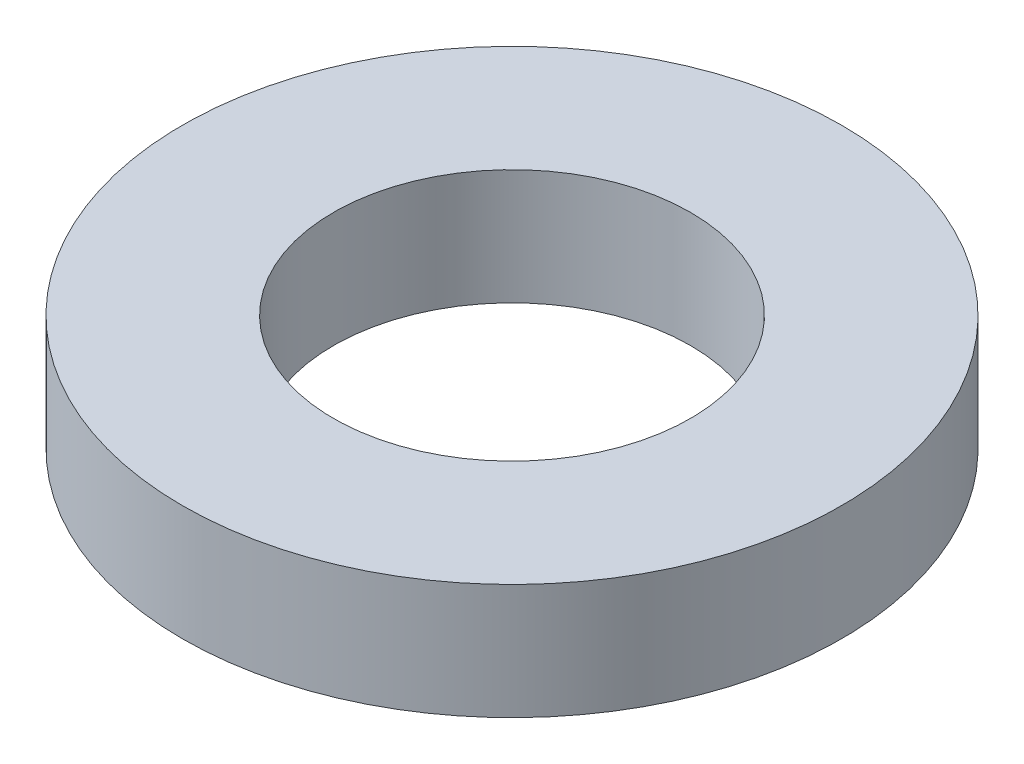
ISO-10303-21;
HEADER;
FILE_DESCRIPTION(('STEP AP214'),'2;1');
FILE_NAME('part.step','',(''),(''),'','','');
FILE_SCHEMA(('AUTOMOTIVE_DESIGN { 1 0 10303 214 1 1 1 1 }'));
ENDSEC;
DATA;
#1=APPLICATION_CONTEXT('core data for automotive mechanical design processes');
#2=APPLICATION_PROTOCOL_DEFINITION('international standard','automotive_design',2000,#1);
#3=PRODUCT_CONTEXT('',#1,'mechanical');
#4=PRODUCT('Part','Part','',(#3));
#5=PRODUCT_RELATED_PRODUCT_CATEGORY('part','',(#4));
#6=PRODUCT_DEFINITION_FORMATION('','',#4);
#7=PRODUCT_DEFINITION_CONTEXT('part definition',#1,'design');
#8=PRODUCT_DEFINITION('design','',#6,#7);
#9=PRODUCT_DEFINITION_SHAPE('','',#8);
#10=(LENGTH_UNIT() NAMED_UNIT(*) SI_UNIT(.MILLI.,.METRE.));
#11=(NAMED_UNIT(*) PLANE_ANGLE_UNIT() SI_UNIT($,.RADIAN.));
#12=(NAMED_UNIT(*) SI_UNIT($,.STERADIAN.) SOLID_ANGLE_UNIT());
#13=UNCERTAINTY_MEASURE_WITH_UNIT(LENGTH_MEASURE(1.E-05),#10,'distance_accuracy_value','');
#14=(GEOMETRIC_REPRESENTATION_CONTEXT(3) GLOBAL_UNCERTAINTY_ASSIGNED_CONTEXT((#13)) GLOBAL_UNIT_ASSIGNED_CONTEXT((#10,
#11,#12)) REPRESENTATION_CONTEXT('',''));
#15=CARTESIAN_POINT('',(0.,0.,0.));
#16=DIRECTION('',(0.,0.,1.));
#17=DIRECTION('',(1.,0.,0.));
#18=AXIS2_PLACEMENT_3D('',#15,#16,#17);
#19=CARTESIAN_POINT('',(0.,21.,0.));
#20=DIRECTION('',(0.,-1.,0.));
#21=DIRECTION('',(0.,0.,-1.));
#22=AXIS2_PLACEMENT_3D('',#19,#20,#21);
#23=CYLINDRICAL_SURFACE('',#22,60.);
#24=CARTESIAN_POINT('',(0.,21.,0.));
#25=DIRECTION('',(0.,1.,0.));
#26=DIRECTION('',(0.,0.,1.));
#27=AXIS2_PLACEMENT_3D('',#24,#25,#26);
#28=CIRCLE('',#27,60.);
#29=CARTESIAN_POINT('',(0.,21.,-60.));
#30=VERTEX_POINT('',#29);
#31=EDGE_CURVE('E10',#30,#30,#28,.T.);
#32=CARTESIAN_POINT('',(0.,0.,0.));
#33=DIRECTION('',(0.,1.,0.));
#34=DIRECTION('',(0.,0.,1.));
#35=AXIS2_PLACEMENT_3D('',#32,#33,#34);
#36=CIRCLE('',#35,60.);
#37=CARTESIAN_POINT('',(0.,0.,-60.));
#38=VERTEX_POINT('',#37);
#39=EDGE_CURVE('E37',#38,#38,#36,.T.);
#40=CARTESIAN_POINT('',(0.,21.,-60.));
#41=CARTESIAN_POINT('',(0.,20.78125,-60.));
#42=CARTESIAN_POINT('',(0.,20.5625,-60.));
#43=CARTESIAN_POINT('',(0.,20.125,-60.));
#44=CARTESIAN_POINT('',(0.,19.90625,-60.));
#45=CARTESIAN_POINT('',(0.,19.46875,-60.));
#46=CARTESIAN_POINT('',(0.,19.25,-60.));
#47=CARTESIAN_POINT('',(0.,18.8125,-60.));
#48=CARTESIAN_POINT('',(0.,18.59375,-60.));
#49=CARTESIAN_POINT('',(0.,18.15625,-60.));
#50=CARTESIAN_POINT('',(0.,17.9375,-60.));
#51=CARTESIAN_POINT('',(0.,17.5,-60.));
#52=CARTESIAN_POINT('',(0.,17.28125,-60.));
#53=CARTESIAN_POINT('',(0.,16.84375,-60.));
#54=CARTESIAN_POINT('',(0.,16.625,-60.));
#55=CARTESIAN_POINT('',(0.,16.1875,-60.));
#56=CARTESIAN_POINT('',(0.,15.96875,-60.));
#57=CARTESIAN_POINT('',(0.,15.53125,-60.));
#58=CARTESIAN_POINT('',(0.,15.3125,-60.));
#59=CARTESIAN_POINT('',(0.,14.875,-60.));
#60=CARTESIAN_POINT('',(0.,14.65625,-60.));
#61=CARTESIAN_POINT('',(0.,14.21875,-60.));
#62=CARTESIAN_POINT('',(0.,14.,-60.));
#63=CARTESIAN_POINT('',(0.,13.5625,-60.));
#64=CARTESIAN_POINT('',(0.,13.34375,-60.));
#65=CARTESIAN_POINT('',(0.,12.90625,-60.));
#66=CARTESIAN_POINT('',(0.,12.6875,-60.));
#67=CARTESIAN_POINT('',(0.,12.25,-60.));
#68=CARTESIAN_POINT('',(0.,12.03125,-60.));
#69=CARTESIAN_POINT('',(0.,11.59375,-60.));
#70=CARTESIAN_POINT('',(0.,11.375,-60.));
#71=CARTESIAN_POINT('',(0.,10.9375,-60.));
#72=CARTESIAN_POINT('',(0.,10.71875,-60.));
#73=CARTESIAN_POINT('',(0.,10.28125,-60.));
#74=CARTESIAN_POINT('',(0.,10.0625,-60.));
#75=CARTESIAN_POINT('',(0.,9.625,-60.));
#76=CARTESIAN_POINT('',(0.,9.40625,-60.));
#77=CARTESIAN_POINT('',(0.,8.96875,-60.));
#78=CARTESIAN_POINT('',(0.,8.75,-60.));
#79=CARTESIAN_POINT('',(0.,8.3125,-60.));
#80=CARTESIAN_POINT('',(0.,8.09375,-60.));
#81=CARTESIAN_POINT('',(0.,7.65625,-60.));
#82=CARTESIAN_POINT('',(0.,7.4375,-60.));
#83=CARTESIAN_POINT('',(0.,7.,-60.));
#84=CARTESIAN_POINT('',(0.,6.78125,-60.));
#85=CARTESIAN_POINT('',(0.,6.34375,-60.));
#86=CARTESIAN_POINT('',(0.,6.125,-60.));
#87=CARTESIAN_POINT('',(0.,5.6875,-60.));
#88=CARTESIAN_POINT('',(0.,5.46875,-60.));
#89=CARTESIAN_POINT('',(0.,5.03125,-60.));
#90=CARTESIAN_POINT('',(0.,4.8125,-60.));
#91=CARTESIAN_POINT('',(0.,4.375,-60.));
#92=CARTESIAN_POINT('',(0.,4.15625,-60.));
#93=CARTESIAN_POINT('',(0.,3.71875,-60.));
#94=CARTESIAN_POINT('',(0.,3.5,-60.));
#95=CARTESIAN_POINT('',(0.,3.0625,-60.));
#96=CARTESIAN_POINT('',(0.,2.84375,-60.));
#97=CARTESIAN_POINT('',(0.,2.40625,-60.));
#98=CARTESIAN_POINT('',(0.,2.1875,-60.));
#99=CARTESIAN_POINT('',(0.,1.75,-60.));
#100=CARTESIAN_POINT('',(0.,1.53125,-60.));
#101=CARTESIAN_POINT('',(0.,1.09375,-60.));
#102=CARTESIAN_POINT('',(0.,0.875000000000001,-60.));
#103=CARTESIAN_POINT('',(0.,0.4375,-60.));
#104=CARTESIAN_POINT('',(0.,0.21875,-60.));
#105=CARTESIAN_POINT('',(0.,0.,-60.));
#106=B_SPLINE_CURVE_WITH_KNOTS('',3,(#40,#41,#42,#43,#44,#45,#46,#47,#48,#49,#50,#51,#52,#53,
#54,#55,#56,#57,#58,#59,#60,#61,#62,#63,#64,#65,#66,#67,#68,#69,#70,#71,#72,#73,#74,#75,#76,#77,
#78,#79,#80,#81,#82,#83,#84,#85,#86,#87,#88,#89,#90,#91,#92,#93,#94,#95,#96,#97,#98,#99,#100,
#101,#102,#103,#104,#105),.UNSPECIFIED.,.F.,.F.,(4,2,2,2,2,2,2,2,2,2,2,2,2,2,2,2,2,2,2,2,2,2,2,
2,2,2,2,2,2,2,2,2,4),(0.,0.656250000000001,1.3125,1.96875,2.625,3.28125,3.9375,4.59375,5.25,
5.90625,6.5625,7.21875,7.875,8.53125,9.1875,9.84375,10.5,11.15625,11.8125,12.46875,13.125,
13.78125,14.4375,15.09375,15.75,16.40625,17.0625,17.71875,18.375,19.03125,19.6875,20.34375,21.),.UNSPECIFIED.);
#107=EDGE_CURVE('BSEAM40',#30,#38,#106,.T.);
#108=ORIENTED_EDGE('',*,*,#31,.F.);
#109=ORIENTED_EDGE('',*,*,#39,.T.);
#110=ORIENTED_EDGE('',*,*,#107,.T.);
#111=ORIENTED_EDGE('',*,*,#107,.F.);
#112=EDGE_LOOP('',(#108,#110,#109,#111));
#113=FACE_BOUND('',#112,.T.);
#114=ADVANCED_FACE('F40',(#113),#23,.T.);
#115=CARTESIAN_POINT('',(0.,21.,0.));
#116=DIRECTION('',(0.,1.,0.));
#117=DIRECTION('',(0.,0.,1.));
#118=AXIS2_PLACEMENT_3D('',#115,#116,#117);
#119=PLANE('',#118);
#120=CARTESIAN_POINT('',(0.,21.,0.));
#121=DIRECTION('',(0.,1.,0.));
#122=DIRECTION('',(0.,0.,1.));
#123=AXIS2_PLACEMENT_3D('',#120,#121,#122);
#124=CIRCLE('',#123,32.5);
#125=CARTESIAN_POINT('',(0.,21.,-32.5));
#126=VERTEX_POINT('',#125);
#127=EDGE_CURVE('E50',#126,#126,#124,.T.);
#128=ORIENTED_EDGE('',*,*,#127,.F.);
#129=EDGE_LOOP('',(#128));
#130=FACE_BOUND('',#129,.T.);
#131=ORIENTED_EDGE('',*,*,#31,.T.);
#132=EDGE_LOOP('',(#131));
#133=FACE_BOUND('',#132,.T.);
#134=ADVANCED_FACE('F59',(#130,#133),#119,.T.);
#135=CARTESIAN_POINT('',(0.,0.,0.));
#136=DIRECTION('',(0.,1.,0.));
#137=DIRECTION('',(0.,0.,1.));
#138=AXIS2_PLACEMENT_3D('',#135,#136,#137);
#139=PLANE('',#138);
#140=CARTESIAN_POINT('',(0.,0.,0.));
#141=DIRECTION('',(0.,1.,0.));
#142=DIRECTION('',(0.,0.,1.));
#143=AXIS2_PLACEMENT_3D('',#140,#141,#142);
#144=CIRCLE('',#143,32.5);
#145=CARTESIAN_POINT('',(0.,0.,-32.5));
#146=VERTEX_POINT('',#145);
#147=EDGE_CURVE('E47',#146,#146,#144,.T.);
#148=ORIENTED_EDGE('',*,*,#147,.T.);
#149=EDGE_LOOP('',(#148));
#150=FACE_BOUND('',#149,.T.);
#151=ORIENTED_EDGE('',*,*,#39,.F.);
#152=EDGE_LOOP('',(#151));
#153=FACE_BOUND('',#152,.T.);
#154=ADVANCED_FACE('F58',(#150,#153),#139,.F.);
#155=CARTESIAN_POINT('',(0.,21.,0.));
#156=DIRECTION('',(0.,-1.,0.));
#157=DIRECTION('',(0.,0.,-1.));
#158=AXIS2_PLACEMENT_3D('',#155,#156,#157);
#159=CYLINDRICAL_SURFACE('',#158,32.5);
#160=CARTESIAN_POINT('',(0.,21.,-32.5));
#161=CARTESIAN_POINT('',(0.,20.78125,-32.5));
#162=CARTESIAN_POINT('',(0.,20.5625,-32.5));
#163=CARTESIAN_POINT('',(0.,20.125,-32.5));
#164=CARTESIAN_POINT('',(0.,19.90625,-32.5));
#165=CARTESIAN_POINT('',(0.,19.46875,-32.5));
#166=CARTESIAN_POINT('',(0.,19.25,-32.5));
#167=CARTESIAN_POINT('',(0.,18.8125,-32.5));
#168=CARTESIAN_POINT('',(0.,18.59375,-32.5));
#169=CARTESIAN_POINT('',(0.,18.15625,-32.5));
#170=CARTESIAN_POINT('',(0.,17.9375,-32.5));
#171=CARTESIAN_POINT('',(0.,17.5,-32.5));
#172=CARTESIAN_POINT('',(0.,17.28125,-32.5));
#173=CARTESIAN_POINT('',(0.,16.84375,-32.5));
#174=CARTESIAN_POINT('',(0.,16.625,-32.5));
#175=CARTESIAN_POINT('',(0.,16.1875,-32.5));
#176=CARTESIAN_POINT('',(0.,15.96875,-32.5));
#177=CARTESIAN_POINT('',(0.,15.53125,-32.5));
#178=CARTESIAN_POINT('',(0.,15.3125,-32.5));
#179=CARTESIAN_POINT('',(0.,14.875,-32.5));
#180=CARTESIAN_POINT('',(0.,14.65625,-32.5));
#181=CARTESIAN_POINT('',(0.,14.21875,-32.5));
#182=CARTESIAN_POINT('',(0.,14.,-32.5));
#183=CARTESIAN_POINT('',(0.,13.5625,-32.5));
#184=CARTESIAN_POINT('',(0.,13.34375,-32.5));
#185=CARTESIAN_POINT('',(0.,12.90625,-32.5));
#186=CARTESIAN_POINT('',(0.,12.6875,-32.5));
#187=CARTESIAN_POINT('',(0.,12.25,-32.5));
#188=CARTESIAN_POINT('',(0.,12.03125,-32.5));
#189=CARTESIAN_POINT('',(0.,11.59375,-32.5));
#190=CARTESIAN_POINT('',(0.,11.375,-32.5));
#191=CARTESIAN_POINT('',(0.,10.9375,-32.5));
#192=CARTESIAN_POINT('',(0.,10.71875,-32.5));
#193=CARTESIAN_POINT('',(0.,10.28125,-32.5));
#194=CARTESIAN_POINT('',(0.,10.0625,-32.5));
#195=CARTESIAN_POINT('',(0.,9.625,-32.5));
#196=CARTESIAN_POINT('',(0.,9.40625,-32.5));
#197=CARTESIAN_POINT('',(0.,8.96875,-32.5));
#198=CARTESIAN_POINT('',(0.,8.75,-32.5));
#199=CARTESIAN_POINT('',(0.,8.3125,-32.5));
#200=CARTESIAN_POINT('',(0.,8.09375,-32.5));
#201=CARTESIAN_POINT('',(0.,7.65625,-32.5));
#202=CARTESIAN_POINT('',(0.,7.4375,-32.5));
#203=CARTESIAN_POINT('',(0.,7.,-32.5));
#204=CARTESIAN_POINT('',(0.,6.78125,-32.5));
#205=CARTESIAN_POINT('',(0.,6.34375,-32.5));
#206=CARTESIAN_POINT('',(0.,6.125,-32.5));
#207=CARTESIAN_POINT('',(0.,5.6875,-32.5));
#208=CARTESIAN_POINT('',(0.,5.46875,-32.5));
#209=CARTESIAN_POINT('',(0.,5.03125,-32.5));
#210=CARTESIAN_POINT('',(0.,4.8125,-32.5));
#211=CARTESIAN_POINT('',(0.,4.375,-32.5));
#212=CARTESIAN_POINT('',(0.,4.15625,-32.5));
#213=CARTESIAN_POINT('',(0.,3.71875,-32.5));
#214=CARTESIAN_POINT('',(0.,3.5,-32.5));
#215=CARTESIAN_POINT('',(0.,3.0625,-32.5));
#216=CARTESIAN_POINT('',(0.,2.84375,-32.5));
#217=CARTESIAN_POINT('',(0.,2.40625,-32.5));
#218=CARTESIAN_POINT('',(0.,2.1875,-32.5));
#219=CARTESIAN_POINT('',(0.,1.75,-32.5));
#220=CARTESIAN_POINT('',(0.,1.53125,-32.5));
#221=CARTESIAN_POINT('',(0.,1.09375,-32.5));
#222=CARTESIAN_POINT('',(0.,0.875000000000001,-32.5));
#223=CARTESIAN_POINT('',(0.,0.4375,-32.5));
#224=CARTESIAN_POINT('',(0.,0.21875,-32.5));
#225=CARTESIAN_POINT('',(0.,0.,-32.5));
#226=B_SPLINE_CURVE_WITH_KNOTS('',3,(#160,#161,#162,#163,#164,#165,#166,#167,#168,#169,#170,
#171,#172,#173,#174,#175,#176,#177,#178,#179,#180,#181,#182,#183,#184,#185,#186,#187,#188,#189,
#190,#191,#192,#193,#194,#195,#196,#197,#198,#199,#200,#201,#202,#203,#204,#205,#206,#207,#208,
#209,#210,#211,#212,#213,#214,#215,#216,#217,#218,#219,#220,#221,#222,#223,#224,#225),
.UNSPECIFIED.,.F.,.F.,(4,2,2,2,2,2,2,2,2,2,2,2,2,2,2,2,2,2,2,2,2,2,2,2,2,2,2,2,2,2,2,2,4),(0.,
0.656249999999997,1.3125,1.96875,2.625,3.28125,3.9375,4.59375,5.25,5.90625,6.5625,7.21875,7.875,
8.53125,9.1875,9.84375,10.5,11.15625,11.8125,12.46875,13.125,13.78125,14.4375,15.09375,15.75,
16.40625,17.0625,17.71875,18.375,19.03125,19.6875,20.34375,21.),.UNSPECIFIED.);
#227=EDGE_CURVE('BSEAM54',#126,#146,#226,.T.);
#228=ORIENTED_EDGE('',*,*,#127,.T.);
#229=ORIENTED_EDGE('',*,*,#147,.F.);
#230=ORIENTED_EDGE('',*,*,#227,.T.);
#231=ORIENTED_EDGE('',*,*,#227,.F.);
#232=EDGE_LOOP('',(#228,#230,#229,#231));
#233=FACE_BOUND('',#232,.T.);
#234=ADVANCED_FACE('F54',(#233),#159,.F.);
#235=CLOSED_SHELL('',(#114,#134,#154,#234));
#236=MANIFOLD_SOLID_BREP('B2',#235);
#237=ADVANCED_BREP_SHAPE_REPRESENTATION('',(#18,#236),#14);
#238=SHAPE_DEFINITION_REPRESENTATION(#9,#237);
ENDSEC;
END-ISO-10303-21;
